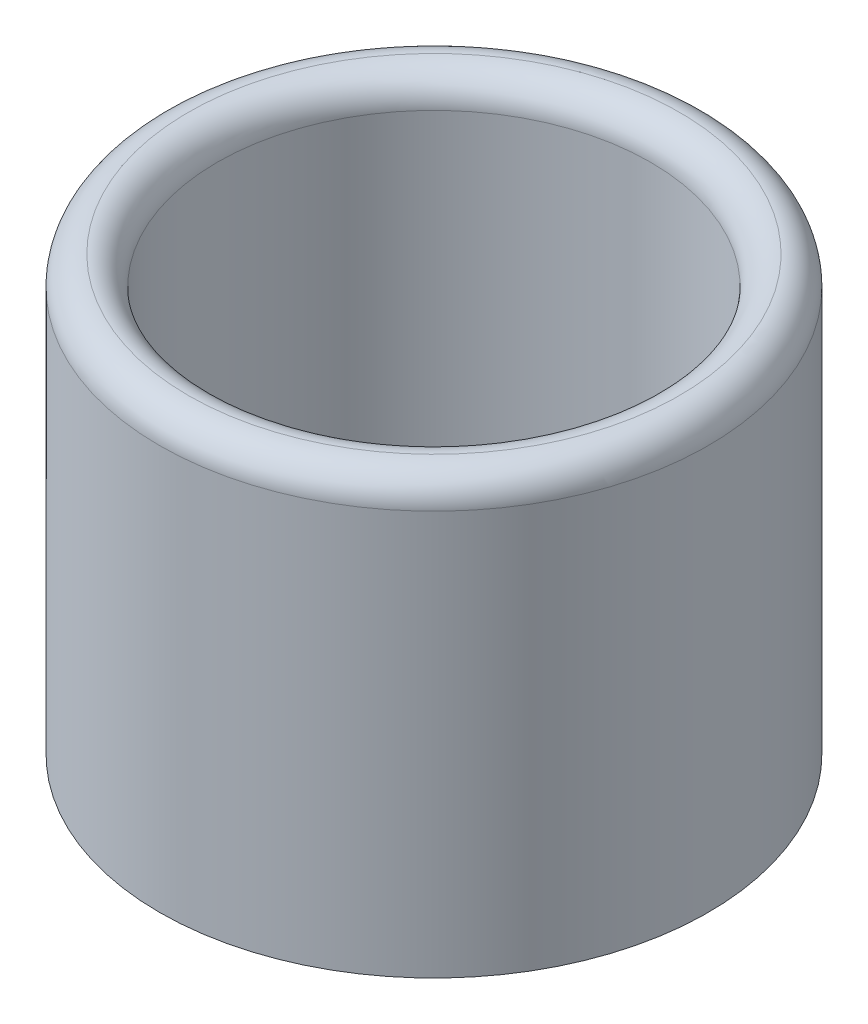
ISO-10303-21;
HEADER;
FILE_DESCRIPTION(('STEP AP214'),'2;1');
FILE_NAME('part.step','',(''),(''),'','','');
FILE_SCHEMA(('AUTOMOTIVE_DESIGN { 1 0 10303 214 1 1 1 1 }'));
ENDSEC;
DATA;
#1=APPLICATION_CONTEXT('core data for automotive mechanical design processes');
#2=APPLICATION_PROTOCOL_DEFINITION('international standard','automotive_design',2000,#1);
#3=PRODUCT_CONTEXT('',#1,'mechanical');
#4=PRODUCT('Part','Part','',(#3));
#5=PRODUCT_RELATED_PRODUCT_CATEGORY('part','',(#4));
#6=PRODUCT_DEFINITION_FORMATION('','',#4);
#7=PRODUCT_DEFINITION_CONTEXT('part definition',#1,'design');
#8=PRODUCT_DEFINITION('design','',#6,#7);
#9=PRODUCT_DEFINITION_SHAPE('','',#8);
#10=(LENGTH_UNIT() NAMED_UNIT(*) SI_UNIT(.MILLI.,.METRE.));
#11=(NAMED_UNIT(*) PLANE_ANGLE_UNIT() SI_UNIT($,.RADIAN.));
#12=(NAMED_UNIT(*) SI_UNIT($,.STERADIAN.) SOLID_ANGLE_UNIT());
#13=UNCERTAINTY_MEASURE_WITH_UNIT(LENGTH_MEASURE(1.E-05),#10,'distance_accuracy_value','');
#14=(GEOMETRIC_REPRESENTATION_CONTEXT(3) GLOBAL_UNCERTAINTY_ASSIGNED_CONTEXT((#13)) GLOBAL_UNIT_ASSIGNED_CONTEXT((#10,
#11,#12)) REPRESENTATION_CONTEXT('',''));
#15=CARTESIAN_POINT('',(0.,0.,0.));
#16=DIRECTION('',(0.,0.,1.));
#17=DIRECTION('',(1.,0.,0.));
#18=AXIS2_PLACEMENT_3D('',#15,#16,#17);
#19=CARTESIAN_POINT('',(-1.83475808418499E-06,6.,-48.8530272673939));
#20=DIRECTION('',(0.,-1.,0.));
#21=DIRECTION('',(0.,0.,-1.));
#22=AXIS2_PLACEMENT_3D('',#19,#20,#21);
#23=CYLINDRICAL_SURFACE('',#22,3.);
#24=CARTESIAN_POINT('',(-1.83475808418499E-06,5.6,-48.8530272673939));
#25=DIRECTION('',(0.,1.,0.));
#26=DIRECTION('',(0.,0.,1.));
#27=AXIS2_PLACEMENT_3D('',#24,#25,#26);
#28=CIRCLE('',#27,3.);
#29=CARTESIAN_POINT('',(-1.83475808418499E-06,5.6,-45.8530272673939));
#30=VERTEX_POINT('',#29);
#31=EDGE_CURVE('E10',#30,#30,#28,.T.);
#32=ORIENTED_EDGE('',*,*,#31,.T.);
#33=EDGE_LOOP('',(#32));
#34=FACE_BOUND('',#33,.T.);
#35=CARTESIAN_POINT('',(-1.83475808418499E-06,0.8,-48.8530272673939));
#36=DIRECTION('',(0.,1.,0.));
#37=DIRECTION('',(0.,0.,1.));
#38=AXIS2_PLACEMENT_3D('',#35,#36,#37);
#39=CIRCLE('',#38,3.);
#40=CARTESIAN_POINT('',(-1.83475808418499E-06,0.8,-45.8530272673939));
#41=VERTEX_POINT('',#40);
#42=EDGE_CURVE('E48',#41,#41,#39,.T.);
#43=ORIENTED_EDGE('',*,*,#42,.F.);
#44=EDGE_LOOP('',(#43));
#45=FACE_BOUND('',#44,.T.);
#46=ADVANCED_FACE('F36',(#34,#45),#23,.F.);
#47=CARTESIAN_POINT('',(-1.83475808418499E-06,6.,-48.8530272673939));
#48=DIRECTION('',(0.,-1.,0.));
#49=DIRECTION('',(0.,0.,-1.));
#50=AXIS2_PLACEMENT_3D('',#47,#48,#49);
#51=CYLINDRICAL_SURFACE('',#50,3.8);
#52=CARTESIAN_POINT('',(-1.83475808418499E-06,5.6,-48.8530272673939));
#53=DIRECTION('',(0.,1.,0.));
#54=DIRECTION('',(0.,0.,1.));
#55=AXIS2_PLACEMENT_3D('',#52,#53,#54);
#56=CIRCLE('',#55,3.8);
#57=CARTESIAN_POINT('',(-1.83475808418499E-06,5.6,-45.0530272673939));
#58=VERTEX_POINT('',#57);
#59=EDGE_CURVE('E44',#58,#58,#56,.F.);
#60=ORIENTED_EDGE('',*,*,#59,.T.);
#61=EDGE_LOOP('',(#60));
#62=FACE_BOUND('',#61,.T.);
#63=CARTESIAN_POINT('',(-1.83475808418499E-06,0.,-48.8530272673939));
#64=DIRECTION('',(0.,1.,0.));
#65=DIRECTION('',(0.,0.,1.));
#66=AXIS2_PLACEMENT_3D('',#63,#64,#65);
#67=CIRCLE('',#66,3.8);
#68=CARTESIAN_POINT('',(-1.83475808418499E-06,0.,-45.0530272673939));
#69=VERTEX_POINT('',#68);
#70=EDGE_CURVE('E53',#69,#69,#67,.T.);
#71=ORIENTED_EDGE('',*,*,#70,.T.);
#72=EDGE_LOOP('',(#71));
#73=FACE_BOUND('',#72,.T.);
#74=ADVANCED_FACE('F73',(#62,#73),#51,.T.);
#75=CARTESIAN_POINT('',(0.,0.,0.));
#76=DIRECTION('',(0.,1.,0.));
#77=DIRECTION('',(0.,0.,1.));
#78=AXIS2_PLACEMENT_3D('',#75,#76,#77);
#79=PLANE('',#78);
#80=ORIENTED_EDGE('',*,*,#70,.F.);
#81=EDGE_LOOP('',(#80));
#82=FACE_BOUND('',#81,.T.);
#83=CARTESIAN_POINT('',(-1.83475808418499E-06,0.,-48.8530272673939));
#84=DIRECTION('',(0.,1.,0.));
#85=DIRECTION('',(0.,0.,1.));
#86=AXIS2_PLACEMENT_3D('',#83,#84,#85);
#87=CIRCLE('',#86,1.5);
#88=CARTESIAN_POINT('',(-1.83475808418499E-06,0.,-47.3530272673939));
#89=VERTEX_POINT('',#88);
#90=EDGE_CURVE('E57',#89,#89,#87,.T.);
#91=ORIENTED_EDGE('',*,*,#90,.T.);
#92=EDGE_LOOP('',(#91));
#93=FACE_BOUND('',#92,.T.);
#94=ADVANCED_FACE('F78',(#82,#93),#79,.F.);
#95=CARTESIAN_POINT('',(-1.83475808418499E-06,0.8,-48.8530272673939));
#96=DIRECTION('',(0.,-1.,0.));
#97=DIRECTION('',(0.,0.,-1.));
#98=AXIS2_PLACEMENT_3D('',#95,#96,#97);
#99=CYLINDRICAL_SURFACE('',#98,1.5);
#100=CARTESIAN_POINT('',(-1.83475808418499E-06,0.8,-48.8530272673939));
#101=DIRECTION('',(0.,1.,0.));
#102=DIRECTION('',(0.,0.,1.));
#103=AXIS2_PLACEMENT_3D('',#100,#101,#102);
#104=CIRCLE('',#103,1.5);
#105=CARTESIAN_POINT('',(-1.83475808418499E-06,0.8,-47.3530272673939));
#106=VERTEX_POINT('',#105);
#107=EDGE_CURVE('E56',#106,#106,#104,.T.);
#108=ORIENTED_EDGE('',*,*,#107,.T.);
#109=EDGE_LOOP('',(#108));
#110=FACE_BOUND('',#109,.T.);
#111=ORIENTED_EDGE('',*,*,#90,.F.);
#112=EDGE_LOOP('',(#111));
#113=FACE_BOUND('',#112,.T.);
#114=ADVANCED_FACE('F63',(#110,#113),#99,.F.);
#115=CARTESIAN_POINT('',(0.,0.8,0.));
#116=DIRECTION('',(0.,1.,0.));
#117=DIRECTION('',(0.,0.,1.));
#118=AXIS2_PLACEMENT_3D('',#115,#116,#117);
#119=PLANE('',#118);
#120=ORIENTED_EDGE('',*,*,#107,.F.);
#121=EDGE_LOOP('',(#120));
#122=FACE_BOUND('',#121,.T.);
#123=ORIENTED_EDGE('',*,*,#42,.T.);
#124=EDGE_LOOP('',(#123));
#125=FACE_BOUND('',#124,.T.);
#126=ADVANCED_FACE('F66',(#122,#125),#119,.T.);
#127=CARTESIAN_POINT('',(-1.83475808418499E-06,5.6,-48.8530272673939));
#128=DIRECTION('',(0.,1.,0.));
#129=DIRECTION('',(0.,0.,1.));
#130=AXIS2_PLACEMENT_3D('',#127,#128,#129);
#131=TOROIDAL_SURFACE('',#130,3.4,0.4);
#132=ORIENTED_EDGE('',*,*,#31,.F.);
#133=EDGE_LOOP('',(#132));
#134=FACE_BOUND('',#133,.T.);
#135=CARTESIAN_POINT('',(-1.83475808418499E-06,6.,-48.8530272673939));
#136=DIRECTION('',(0.,1.,0.));
#137=DIRECTION('',(0.,0.,1.));
#138=AXIS2_PLACEMENT_3D('',#135,#136,#137);
#139=CIRCLE('',#138,3.4);
#140=CARTESIAN_POINT('',(-1.83475808418499E-06,6.,-45.4530272673939));
#141=VERTEX_POINT('',#140);
#142=EDGE_CURVE('E40',#141,#141,#139,.F.);
#143=ORIENTED_EDGE('',*,*,#142,.F.);
#144=EDGE_LOOP('',(#143));
#145=FACE_BOUND('',#144,.T.);
#146=ADVANCED_FACE('F38',(#134,#145),#131,.T.);
#147=CARTESIAN_POINT('',(-1.83475808418499E-06,5.6,-48.8530272673939));
#148=DIRECTION('',(0.,1.,0.));
#149=DIRECTION('',(0.,0.,1.));
#150=AXIS2_PLACEMENT_3D('',#147,#148,#149);
#151=TOROIDAL_SURFACE('',#150,3.4,0.4);
#152=ORIENTED_EDGE('',*,*,#59,.F.);
#153=EDGE_LOOP('',(#152));
#154=FACE_BOUND('',#153,.T.);
#155=ORIENTED_EDGE('',*,*,#142,.T.);
#156=EDGE_LOOP('',(#155));
#157=FACE_BOUND('',#156,.T.);
#158=ADVANCED_FACE('F82',(#154,#157),#151,.T.);
#159=CLOSED_SHELL('',(#46,#74,#94,#114,#126,#146,#158));
#160=MANIFOLD_SOLID_BREP('B2',#159);
#161=ADVANCED_BREP_SHAPE_REPRESENTATION('',(#18,#160),#14);
#162=SHAPE_DEFINITION_REPRESENTATION(#9,#161);
ENDSEC;
END-ISO-10303-21;
